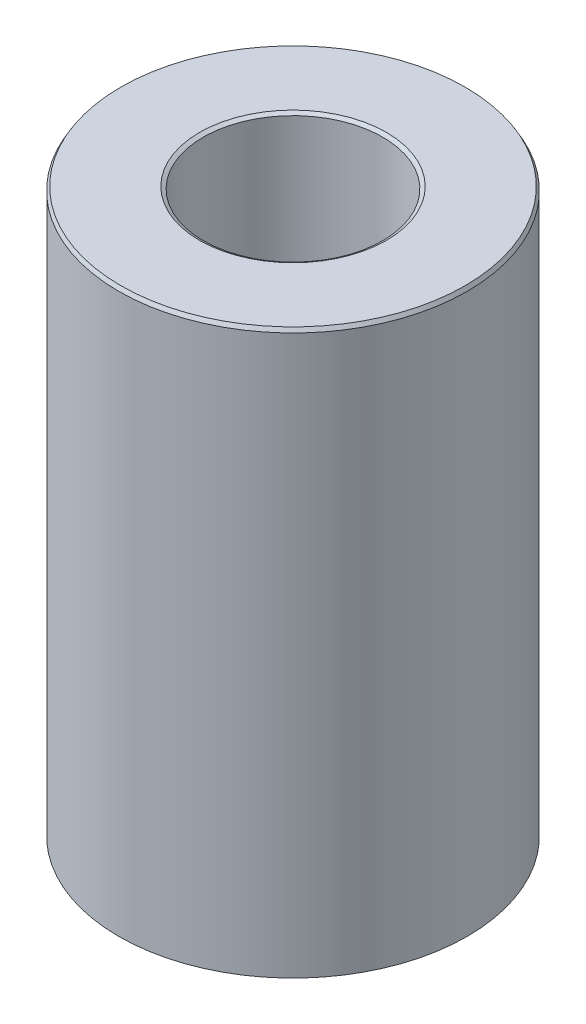
ISO-10303-21;
HEADER;
FILE_DESCRIPTION(('STEP AP214'),'2;1');
FILE_NAME('part.step','',(''),(''),'','','');
FILE_SCHEMA(('AUTOMOTIVE_DESIGN { 1 0 10303 214 1 1 1 1 }'));
ENDSEC;
DATA;
#1=APPLICATION_CONTEXT('core data for automotive mechanical design processes');
#2=APPLICATION_PROTOCOL_DEFINITION('international standard','automotive_design',2000,#1);
#3=PRODUCT_CONTEXT('',#1,'mechanical');
#4=PRODUCT('Part','Part','',(#3));
#5=PRODUCT_RELATED_PRODUCT_CATEGORY('part','',(#4));
#6=PRODUCT_DEFINITION_FORMATION('','',#4);
#7=PRODUCT_DEFINITION_CONTEXT('part definition',#1,'design');
#8=PRODUCT_DEFINITION('design','',#6,#7);
#9=PRODUCT_DEFINITION_SHAPE('','',#8);
#10=(LENGTH_UNIT() NAMED_UNIT(*) SI_UNIT(.MILLI.,.METRE.));
#11=(NAMED_UNIT(*) PLANE_ANGLE_UNIT() SI_UNIT($,.RADIAN.));
#12=(NAMED_UNIT(*) SI_UNIT($,.STERADIAN.) SOLID_ANGLE_UNIT());
#13=UNCERTAINTY_MEASURE_WITH_UNIT(LENGTH_MEASURE(1.E-05),#10,'distance_accuracy_value','');
#14=(GEOMETRIC_REPRESENTATION_CONTEXT(3) GLOBAL_UNCERTAINTY_ASSIGNED_CONTEXT((#13)) GLOBAL_UNIT_ASSIGNED_CONTEXT((#10,
#11,#12)) REPRESENTATION_CONTEXT('',''));
#15=CARTESIAN_POINT('',(0.,0.,0.));
#16=DIRECTION('',(0.,0.,1.));
#17=DIRECTION('',(1.,0.,0.));
#18=AXIS2_PLACEMENT_3D('',#15,#16,#17);
#19=CARTESIAN_POINT('',(0.,186.307645892418,0.));
#20=DIRECTION('',(0.,-1.,0.));
#21=DIRECTION('',(0.,0.,-1.));
#22=AXIS2_PLACEMENT_3D('',#19,#20,#21);
#23=CYLINDRICAL_SURFACE('',#22,57.5);
#24=CARTESIAN_POINT('',(0.,0.716382166384782,0.));
#25=DIRECTION('',(0.,1.,0.));
#26=DIRECTION('',(0.,0.,1.));
#27=AXIS2_PLACEMENT_3D('',#24,#25,#26);
#28=CIRCLE('',#27,57.5);
#29=CARTESIAN_POINT('',(0.,0.716382166384782,57.5));
#30=VERTEX_POINT('',#29);
#31=EDGE_CURVE('E10',#30,#30,#28,.T.);
#32=ORIENTED_EDGE('',*,*,#31,.T.);
#33=EDGE_LOOP('',(#32));
#34=FACE_BOUND('',#33,.T.);
#35=CARTESIAN_POINT('',(0.,185.066835582603,0.));
#36=DIRECTION('',(0.,1.,0.));
#37=DIRECTION('',(0.,0.,1.));
#38=AXIS2_PLACEMENT_3D('',#35,#36,#37);
#39=CIRCLE('',#38,57.5);
#40=CARTESIAN_POINT('',(0.,185.066835582603,57.5));
#41=VERTEX_POINT('',#40);
#42=EDGE_CURVE('E50',#41,#41,#39,.F.);
#43=ORIENTED_EDGE('',*,*,#42,.T.);
#44=EDGE_LOOP('',(#43));
#45=FACE_BOUND('',#44,.T.);
#46=ADVANCED_FACE('F39',(#34,#45),#23,.T.);
#47=CARTESIAN_POINT('',(0.,186.307645892418,0.));
#48=DIRECTION('',(0.,1.,0.));
#49=DIRECTION('',(0.,0.,1.));
#50=AXIS2_PLACEMENT_3D('',#47,#48,#49);
#51=PLANE('',#50);
#52=CARTESIAN_POINT('',(0.,186.307645892418,0.));
#53=DIRECTION('',(0.,1.,0.));
#54=DIRECTION('',(0.,0.,1.));
#55=AXIS2_PLACEMENT_3D('',#52,#53,#54);
#56=CIRCLE('',#55,30.8513189974571);
#57=CARTESIAN_POINT('',(0.,186.307645892418,30.8513189974571));
#58=VERTEX_POINT('',#57);
#59=EDGE_CURVE('E58',#58,#58,#56,.F.);
#60=ORIENTED_EDGE('',*,*,#59,.T.);
#61=EDGE_LOOP('',(#60));
#62=FACE_BOUND('',#61,.T.);
#63=CARTESIAN_POINT('',(0.,186.307645892418,0.));
#64=DIRECTION('',(0.,1.,0.));
#65=DIRECTION('',(0.,0.,1.));
#66=AXIS2_PLACEMENT_3D('',#63,#64,#65);
#67=CIRCLE('',#66,56.7836178336152);
#68=CARTESIAN_POINT('',(0.,186.307645892418,56.7836178336152));
#69=VERTEX_POINT('',#68);
#70=EDGE_CURVE('E61',#69,#69,#67,.T.);
#71=ORIENTED_EDGE('',*,*,#70,.T.);
#72=EDGE_LOOP('',(#71));
#73=FACE_BOUND('',#72,.T.);
#74=ADVANCED_FACE('F88',(#62,#73),#51,.T.);
#75=CARTESIAN_POINT('',(0.,0.,0.));
#76=DIRECTION('',(0.,1.,0.));
#77=DIRECTION('',(0.,0.,1.));
#78=AXIS2_PLACEMENT_3D('',#75,#76,#77);
#79=PLANE('',#78);
#80=CARTESIAN_POINT('',(0.,0.,0.));
#81=DIRECTION('',(0.,1.,0.));
#82=DIRECTION('',(0.,0.,1.));
#83=AXIS2_PLACEMENT_3D('',#80,#81,#82);
#84=CIRCLE('',#83,30.3268908540271);
#85=CARTESIAN_POINT('',(0.,0.,30.3268908540271));
#86=VERTEX_POINT('',#85);
#87=EDGE_CURVE('E51',#86,#86,#84,.T.);
#88=ORIENTED_EDGE('',*,*,#87,.T.);
#89=EDGE_LOOP('',(#88));
#90=FACE_BOUND('',#89,.T.);
#91=CARTESIAN_POINT('',(0.,0.,0.));
#92=DIRECTION('',(0.,1.,0.));
#93=DIRECTION('',(0.,0.,1.));
#94=AXIS2_PLACEMENT_3D('',#91,#92,#93);
#95=CIRCLE('',#94,56.2591896901853);
#96=CARTESIAN_POINT('',(0.,0.,56.2591896901853));
#97=VERTEX_POINT('',#96);
#98=EDGE_CURVE('E54',#97,#97,#95,.F.);
#99=ORIENTED_EDGE('',*,*,#98,.T.);
#100=EDGE_LOOP('',(#99));
#101=FACE_BOUND('',#100,.T.);
#102=ADVANCED_FACE('F83',(#90,#101),#79,.F.);
#103=CARTESIAN_POINT('',(0.,186.307645892418,0.));
#104=DIRECTION('',(0.,-1.,0.));
#105=DIRECTION('',(0.,0.,-1.));
#106=AXIS2_PLACEMENT_3D('',#103,#104,#105);
#107=CYLINDRICAL_SURFACE('',#106,29.6105086876423);
#108=CARTESIAN_POINT('',(0.,185.591263726033,0.));
#109=DIRECTION('',(0.,1.,0.));
#110=DIRECTION('',(0.,0.,1.));
#111=AXIS2_PLACEMENT_3D('',#108,#109,#110);
#112=CIRCLE('',#111,29.6105086876423);
#113=CARTESIAN_POINT('',(0.,185.591263726033,29.6105086876422));
#114=VERTEX_POINT('',#113);
#115=EDGE_CURVE('E67',#114,#114,#112,.T.);
#116=ORIENTED_EDGE('',*,*,#115,.T.);
#117=EDGE_LOOP('',(#116));
#118=FACE_BOUND('',#117,.T.);
#119=CARTESIAN_POINT('',(0.,1.24081030981477,0.));
#120=DIRECTION('',(0.,1.,0.));
#121=DIRECTION('',(0.,0.,1.));
#122=AXIS2_PLACEMENT_3D('',#119,#120,#121);
#123=CIRCLE('',#122,29.6105086876423);
#124=CARTESIAN_POINT('',(0.,1.24081030981477,29.6105086876423));
#125=VERTEX_POINT('',#124);
#126=EDGE_CURVE('E69',#125,#125,#123,.F.);
#127=ORIENTED_EDGE('',*,*,#126,.T.);
#128=EDGE_LOOP('',(#127));
#129=FACE_BOUND('',#128,.T.);
#130=ADVANCED_FACE('F71',(#118,#129),#107,.F.);
#131=CARTESIAN_POINT('',(0.,185.591263726033,0.));
#132=DIRECTION('',(0.,1.,0.));
#133=DIRECTION('',(0.,0.,1.));
#134=AXIS2_PLACEMENT_3D('',#131,#132,#133);
#135=CONICAL_SURFACE('',#134,29.6105086876423,1.04719755119661);
#136=CARTESIAN_POINT('',(0.,186.307645892418,30.8513189974571));
#137=CARTESIAN_POINT('',(0.,186.300183578185,30.8383938900632));
#138=CARTESIAN_POINT('',(0.,186.292721263952,30.8254687826692));
#139=CARTESIAN_POINT('',(0.,186.277796635485,30.7996185678814));
#140=CARTESIAN_POINT('',(0.,186.270334321252,30.7866934604875));
#141=CARTESIAN_POINT('',(0.,186.255409692786,30.7608432456997));
#142=CARTESIAN_POINT('',(0.,186.247947378553,30.7479181383058));
#143=CARTESIAN_POINT('',(0.,186.233022750086,30.722067923518));
#144=CARTESIAN_POINT('',(0.,186.225560435853,30.7091428161241));
#145=CARTESIAN_POINT('',(0.,186.210635807387,30.6832926013363));
#146=CARTESIAN_POINT('',(0.,186.203173493154,30.6703674939424));
#147=CARTESIAN_POINT('',(0.,186.188248864687,30.6445172791546));
#148=CARTESIAN_POINT('',(0.,186.180786550454,30.6315921717607));
#149=CARTESIAN_POINT('',(0.,186.165861921988,30.6057419569729));
#150=CARTESIAN_POINT('',(0.,186.158399607755,30.592816849579));
#151=CARTESIAN_POINT('',(0.,186.143474979288,30.5669666347912));
#152=CARTESIAN_POINT('',(0.,186.136012665055,30.5540415273973));
#153=CARTESIAN_POINT('',(0.,186.121088036589,30.5281913126094));
#154=CARTESIAN_POINT('',(0.,186.113625722356,30.5152662052155));
#155=CARTESIAN_POINT('',(0.,186.098701093889,30.4894159904277));
#156=CARTESIAN_POINT('',(0.,186.091238779656,30.4764908830338));
#157=CARTESIAN_POINT('',(0.,186.07631415119,30.450640668246));
#158=CARTESIAN_POINT('',(0.,186.068851836957,30.4377155608521));
#159=CARTESIAN_POINT('',(0.,186.05392720849,30.4118653460643));
#160=CARTESIAN_POINT('',(0.,186.046464894257,30.3989402386704));
#161=CARTESIAN_POINT('',(0.,186.031540265791,30.3730900238826));
#162=CARTESIAN_POINT('',(0.,186.024077951558,30.3601649164887));
#163=CARTESIAN_POINT('',(0.,186.009153323091,30.3343147017009));
#164=CARTESIAN_POINT('',(0.,186.001691008858,30.321389594307));
#165=CARTESIAN_POINT('',(0.,185.986766380392,30.2955393795192));
#166=CARTESIAN_POINT('',(0.,185.979304066158,30.2826142721253));
#167=CARTESIAN_POINT('',(0.,185.964379437692,30.2567640573375));
#168=CARTESIAN_POINT('',(0.,185.956917123459,30.2438389499435));
#169=CARTESIAN_POINT('',(0.,185.941992494993,30.2179887351557));
#170=CARTESIAN_POINT('',(0.,185.934530180759,30.2050636277618));
#171=CARTESIAN_POINT('',(0.,185.919605552293,30.179213412974));
#172=CARTESIAN_POINT('',(0.,185.91214323806,30.1662883055801));
#173=CARTESIAN_POINT('',(0.,185.897218609594,30.1404380907923));
#174=CARTESIAN_POINT('',(0.,185.88975629536,30.1275129833984));
#175=CARTESIAN_POINT('',(0.,185.874831666894,30.1016627686106));
#176=CARTESIAN_POINT('',(0.,185.867369352661,30.0887376612167));
#177=CARTESIAN_POINT('',(0.,185.852444724194,30.0628874464289));
#178=CARTESIAN_POINT('',(0.,185.844982409961,30.049962339035));
#179=CARTESIAN_POINT('',(0.,185.830057781495,30.0241121242472));
#180=CARTESIAN_POINT('',(0.,185.822595467262,30.0111870168533));
#181=CARTESIAN_POINT('',(0.,185.807670838795,29.9853368020655));
#182=CARTESIAN_POINT('',(0.,185.800208524562,29.9724116946716));
#183=CARTESIAN_POINT('',(0.,185.785283896096,29.9465614798837));
#184=CARTESIAN_POINT('',(0.,185.777821581863,29.9336363724898));
#185=CARTESIAN_POINT('',(0.,185.762896953396,29.907786157702));
#186=CARTESIAN_POINT('',(0.,185.755434639163,29.8948610503081));
#187=CARTESIAN_POINT('',(0.,185.740510010697,29.8690108355203));
#188=CARTESIAN_POINT('',(0.,185.733047696464,29.8560857281264));
#189=CARTESIAN_POINT('',(0.,185.718123067997,29.8302355133386));
#190=CARTESIAN_POINT('',(0.,185.710660753764,29.8173104059447));
#191=CARTESIAN_POINT('',(0.,185.695736125298,29.7914601911569));
#192=CARTESIAN_POINT('',(0.,185.688273811065,29.778535083763));
#193=CARTESIAN_POINT('',(0.,185.673349182598,29.7526848689752));
#194=CARTESIAN_POINT('',(0.,185.665886868365,29.7397597615813));
#195=CARTESIAN_POINT('',(0.,185.650962239899,29.7139095467935));
#196=CARTESIAN_POINT('',(0.,185.643499925666,29.7009844393996));
#197=CARTESIAN_POINT('',(0.,185.628575297199,29.6751342246118));
#198=CARTESIAN_POINT('',(0.,185.621112982966,29.6622091172178));
#199=CARTESIAN_POINT('',(0.,185.6061883545,29.63635890243));
#200=CARTESIAN_POINT('',(0.,185.598726040267,29.6234337950361));
#201=CARTESIAN_POINT('',(0.,185.591263726033,29.6105086876422));
#202=B_SPLINE_CURVE_WITH_KNOTS('',3,(#136,#137,#138,#139,#140,#141,#142,#143,#144,#145,#146,
#147,#148,#149,#150,#151,#152,#153,#154,#155,#156,#157,#158,#159,#160,#161,#162,#163,#164,#165,
#166,#167,#168,#169,#170,#171,#172,#173,#174,#175,#176,#177,#178,#179,#180,#181,#182,#183,#184,
#185,#186,#187,#188,#189,#190,#191,#192,#193,#194,#195,#196,#197,#198,#199,#200,#201),
.UNSPECIFIED.,.F.,.F.,(4,2,2,2,2,2,2,2,2,2,2,2,2,2,2,2,2,2,2,2,2,2,2,2,2,2,2,2,2,2,2,2,4),(0.,
0.0447738853990473,0.0895477707980946,0.134321656197156,0.179095541596203,0.223869426995264,
0.268643312394312,0.313417197793359,0.35819108319242,0.402964968591468,0.447738853990529,
0.492512739389576,0.537286624788623,0.582060510187684,0.626834395586732,0.671608280985793,
0.71638216638484,0.761156051783887,0.805929937182952,0.850703822581999,0.89547770798106,
0.940251593380107,0.985025478779155,1.02979936417822,1.07457324957726,1.11934713497632,
1.16412102037537,1.20889490577442,1.25366879117348,1.29844267657253,1.34321656197159,
1.38799044737064,1.43276433276968),.UNSPECIFIED.);
#203=EDGE_CURVE('BSEAM77',#58,#114,#202,.T.);
#204=ORIENTED_EDGE('',*,*,#59,.F.);
#205=ORIENTED_EDGE('',*,*,#115,.F.);
#206=ORIENTED_EDGE('',*,*,#203,.T.);
#207=ORIENTED_EDGE('',*,*,#203,.F.);
#208=EDGE_LOOP('',(#204,#206,#205,#207));
#209=FACE_BOUND('',#208,.T.);
#210=ADVANCED_FACE('F77',(#209),#135,.F.);
#211=CARTESIAN_POINT('',(0.,0.,0.));
#212=DIRECTION('',(0.,-1.,0.));
#213=DIRECTION('',(0.,0.,-1.));
#214=AXIS2_PLACEMENT_3D('',#211,#212,#213);
#215=CONICAL_SURFACE('',#214,30.3268908540271,0.523598775598305);
#216=ORIENTED_EDGE('',*,*,#126,.F.);
#217=EDGE_LOOP('',(#216));
#218=FACE_BOUND('',#217,.T.);
#219=ORIENTED_EDGE('',*,*,#87,.F.);
#220=EDGE_LOOP('',(#219));
#221=FACE_BOUND('',#220,.T.);
#222=ADVANCED_FACE('F73',(#218,#221),#215,.F.);
#223=CARTESIAN_POINT('',(0.,0.716382166384782,0.));
#224=DIRECTION('',(0.,1.,0.));
#225=DIRECTION('',(0.,0.,1.));
#226=AXIS2_PLACEMENT_3D('',#223,#224,#225);
#227=CONICAL_SURFACE('',#226,57.5,1.0471975511966);
#228=ORIENTED_EDGE('',*,*,#98,.F.);
#229=EDGE_LOOP('',(#228));
#230=FACE_BOUND('',#229,.T.);
#231=ORIENTED_EDGE('',*,*,#31,.F.);
#232=EDGE_LOOP('',(#231));
#233=FACE_BOUND('',#232,.T.);
#234=ADVANCED_FACE('F76',(#230,#233),#227,.T.);
#235=CARTESIAN_POINT('',(0.,186.307645892418,0.));
#236=DIRECTION('',(0.,-1.,0.));
#237=DIRECTION('',(0.,0.,-1.));
#238=AXIS2_PLACEMENT_3D('',#235,#236,#237);
#239=CONICAL_SURFACE('',#238,56.7836178336152,0.523598775598298);
#240=ORIENTED_EDGE('',*,*,#42,.F.);
#241=EDGE_LOOP('',(#240));
#242=FACE_BOUND('',#241,.T.);
#243=ORIENTED_EDGE('',*,*,#70,.F.);
#244=EDGE_LOOP('',(#243));
#245=FACE_BOUND('',#244,.T.);
#246=ADVANCED_FACE('F45',(#242,#245),#239,.T.);
#247=CLOSED_SHELL('',(#46,#74,#102,#130,#210,#222,#234,#246));
#248=MANIFOLD_SOLID_BREP('B2',#247);
#249=ADVANCED_BREP_SHAPE_REPRESENTATION('',(#18,#248),#14);
#250=SHAPE_DEFINITION_REPRESENTATION(#9,#249);
ENDSEC;
END-ISO-10303-21;
